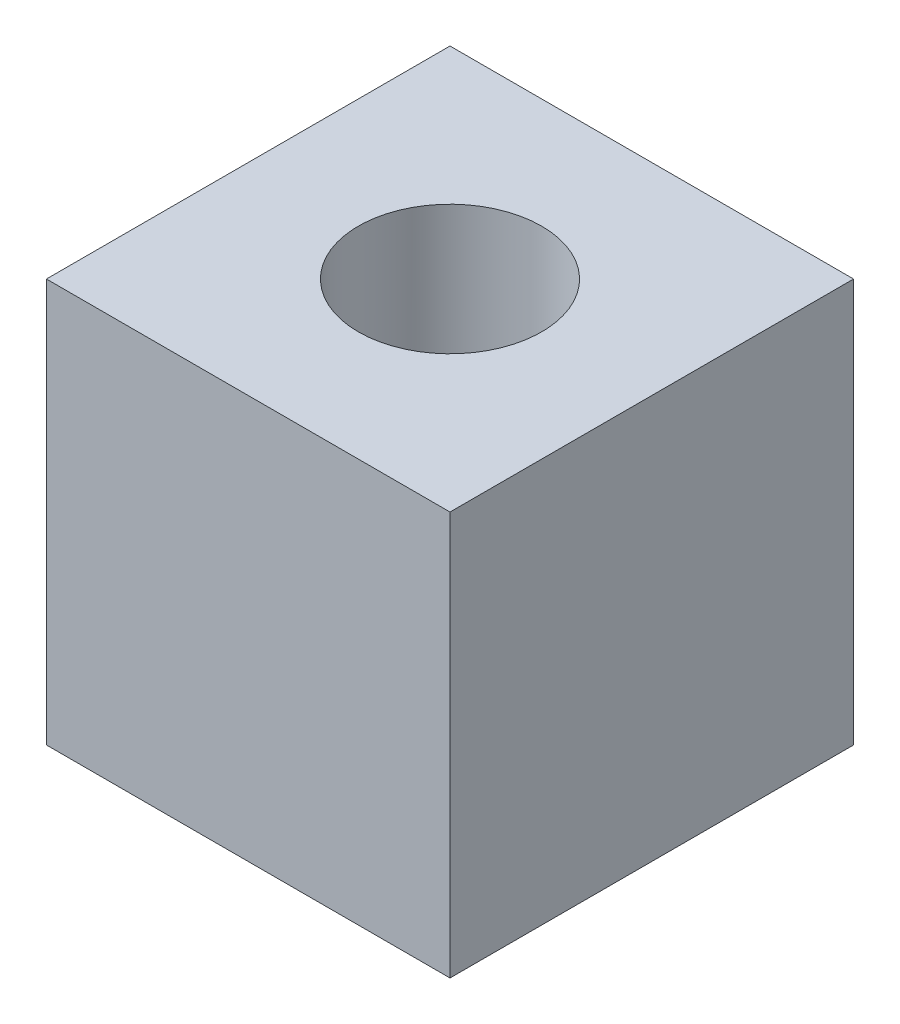
ISO-10303-21;
HEADER;
FILE_DESCRIPTION(('STEP AP214'),'2;1');
FILE_NAME('part.step','',(''),(''),'','','');
FILE_SCHEMA(('AUTOMOTIVE_DESIGN { 1 0 10303 214 1 1 1 1 }'));
ENDSEC;
DATA;
#1=APPLICATION_CONTEXT('core data for automotive mechanical design processes');
#2=APPLICATION_PROTOCOL_DEFINITION('international standard','automotive_design',2000,#1);
#3=PRODUCT_CONTEXT('',#1,'mechanical');
#4=PRODUCT('Part','Part','',(#3));
#5=PRODUCT_RELATED_PRODUCT_CATEGORY('part','',(#4));
#6=PRODUCT_DEFINITION_FORMATION('','',#4);
#7=PRODUCT_DEFINITION_CONTEXT('part definition',#1,'design');
#8=PRODUCT_DEFINITION('design','',#6,#7);
#9=PRODUCT_DEFINITION_SHAPE('','',#8);
#10=(LENGTH_UNIT() NAMED_UNIT(*) SI_UNIT(.MILLI.,.METRE.));
#11=(NAMED_UNIT(*) PLANE_ANGLE_UNIT() SI_UNIT($,.RADIAN.));
#12=(NAMED_UNIT(*) SI_UNIT($,.STERADIAN.) SOLID_ANGLE_UNIT());
#13=UNCERTAINTY_MEASURE_WITH_UNIT(LENGTH_MEASURE(1.E-05),#10,'distance_accuracy_value','');
#14=(GEOMETRIC_REPRESENTATION_CONTEXT(3) GLOBAL_UNCERTAINTY_ASSIGNED_CONTEXT((#13)) GLOBAL_UNIT_ASSIGNED_CONTEXT((#10,
#11,#12)) REPRESENTATION_CONTEXT('',''));
#15=CARTESIAN_POINT('',(0.,0.,0.));
#16=DIRECTION('',(0.,0.,1.));
#17=DIRECTION('',(1.,0.,0.));
#18=AXIS2_PLACEMENT_3D('',#15,#16,#17);
#19=CARTESIAN_POINT('',(0.,12.,0.));
#20=DIRECTION('',(0.,-1.,0.));
#21=DIRECTION('',(0.,0.,-1.));
#22=AXIS2_PLACEMENT_3D('',#19,#20,#21);
#23=CYLINDRICAL_SURFACE('',#22,2.725);
#24=CARTESIAN_POINT('',(0.,12.,0.));
#25=DIRECTION('',(0.,1.,0.));
#26=DIRECTION('',(0.,0.,1.));
#27=AXIS2_PLACEMENT_3D('',#24,#25,#26);
#28=CIRCLE('',#27,2.725);
#29=CARTESIAN_POINT('',(0.,12.,2.725));
#30=VERTEX_POINT('',#29);
#31=EDGE_CURVE('E103',#30,#30,#28,.T.);
#32=ORIENTED_EDGE('',*,*,#31,.T.);
#33=EDGE_LOOP('',(#32));
#34=FACE_BOUND('',#33,.T.);
#35=CARTESIAN_POINT('',(0.,4.,0.));
#36=DIRECTION('',(0.,-1.,0.));
#37=DIRECTION('',(0.,0.,-1.));
#38=AXIS2_PLACEMENT_3D('',#35,#36,#37);
#39=CIRCLE('',#38,2.725);
#40=CARTESIAN_POINT('',(0.,4.,-2.725));
#41=VERTEX_POINT('',#40);
#42=EDGE_CURVE('E120',#41,#41,#39,.F.);
#43=ORIENTED_EDGE('',*,*,#42,.F.);
#44=EDGE_LOOP('',(#43));
#45=FACE_BOUND('',#44,.T.);
#46=ADVANCED_FACE('F35',(#34,#45),#23,.F.);
#47=CARTESIAN_POINT('',(0.,12.,0.));
#48=DIRECTION('',(0.,-1.,0.));
#49=DIRECTION('',(0.,0.,-1.));
#50=AXIS2_PLACEMENT_3D('',#47,#48,#49);
#51=PLANE('',#50);
#52=DIRECTION('',(0.,0.,-1.));
#53=VECTOR('',#52,1.);
#54=CARTESIAN_POINT('',(6.,12.,6.));
#55=LINE('',#54,#53);
#56=CARTESIAN_POINT('',(6.,12.,6.));
#57=VERTEX_POINT('',#56);
#58=CARTESIAN_POINT('',(6.,12.,-6.));
#59=VERTEX_POINT('',#58);
#60=EDGE_CURVE('E88',#57,#59,#55,.T.);
#61=ORIENTED_EDGE('',*,*,#60,.T.);
#62=DIRECTION('',(-1.,0.,0.));
#63=VECTOR('',#62,1.);
#64=CARTESIAN_POINT('',(-6.,12.,-6.));
#65=LINE('',#64,#63);
#66=CARTESIAN_POINT('',(-6.,12.,-6.));
#67=VERTEX_POINT('',#66);
#68=EDGE_CURVE('E82',#59,#67,#65,.T.);
#69=ORIENTED_EDGE('',*,*,#68,.T.);
#70=DIRECTION('',(0.,0.,1.));
#71=VECTOR('',#70,1.);
#72=CARTESIAN_POINT('',(-6.,12.,6.));
#73=LINE('',#72,#71);
#74=CARTESIAN_POINT('',(-6.,12.,6.));
#75=VERTEX_POINT('',#74);
#76=EDGE_CURVE('E86',#67,#75,#73,.T.);
#77=ORIENTED_EDGE('',*,*,#76,.T.);
#78=DIRECTION('',(1.,0.,0.));
#79=VECTOR('',#78,1.);
#80=CARTESIAN_POINT('',(-6.,12.,6.));
#81=LINE('',#80,#79);
#82=EDGE_CURVE('E52',#75,#57,#81,.T.);
#83=ORIENTED_EDGE('',*,*,#82,.T.);
#84=EDGE_LOOP('',(#61,#69,#77,#83));
#85=FACE_BOUND('',#84,.T.);
#86=ORIENTED_EDGE('',*,*,#31,.F.);
#87=EDGE_LOOP('',(#86));
#88=FACE_BOUND('',#87,.T.);
#89=ADVANCED_FACE('F83',(#85,#88),#51,.F.);
#90=CARTESIAN_POINT('',(0.,0.,0.));
#91=DIRECTION('',(0.,-1.,0.));
#92=DIRECTION('',(0.,0.,-1.));
#93=AXIS2_PLACEMENT_3D('',#90,#91,#92);
#94=PLANE('',#93);
#95=DIRECTION('',(0.,0.,-1.));
#96=VECTOR('',#95,1.);
#97=CARTESIAN_POINT('',(6.,0.,6.));
#98=LINE('',#97,#96);
#99=CARTESIAN_POINT('',(6.,0.,6.));
#100=VERTEX_POINT('',#99);
#101=CARTESIAN_POINT('',(6.,0.,-6.));
#102=VERTEX_POINT('',#101);
#103=EDGE_CURVE('E100',#100,#102,#98,.T.);
#104=ORIENTED_EDGE('',*,*,#103,.F.);
#105=DIRECTION('',(1.,0.,0.));
#106=VECTOR('',#105,1.);
#107=CARTESIAN_POINT('',(-6.,0.,6.));
#108=LINE('',#107,#106);
#109=CARTESIAN_POINT('',(-6.,0.,6.));
#110=VERTEX_POINT('',#109);
#111=EDGE_CURVE('E75',#110,#100,#108,.T.);
#112=ORIENTED_EDGE('',*,*,#111,.F.);
#113=DIRECTION('',(0.,0.,1.));
#114=VECTOR('',#113,1.);
#115=CARTESIAN_POINT('',(-6.,0.,6.));
#116=LINE('',#115,#114);
#117=CARTESIAN_POINT('',(-6.,0.,-6.));
#118=VERTEX_POINT('',#117);
#119=EDGE_CURVE('E69',#118,#110,#116,.T.);
#120=ORIENTED_EDGE('',*,*,#119,.F.);
#121=DIRECTION('',(-1.,0.,0.));
#122=VECTOR('',#121,1.);
#123=CARTESIAN_POINT('',(-6.,0.,-6.));
#124=LINE('',#123,#122);
#125=EDGE_CURVE('E92',#102,#118,#124,.T.);
#126=ORIENTED_EDGE('',*,*,#125,.F.);
#127=EDGE_LOOP('',(#104,#112,#120,#126));
#128=FACE_BOUND('',#127,.T.);
#129=CARTESIAN_POINT('',(0.,0.,0.));
#130=DIRECTION('',(0.,-1.,0.));
#131=DIRECTION('',(0.,0.,-1.));
#132=AXIS2_PLACEMENT_3D('',#129,#130,#131);
#133=CIRCLE('',#132,2.25);
#134=CARTESIAN_POINT('',(0.,0.,-2.25));
#135=VERTEX_POINT('',#134);
#136=EDGE_CURVE('E121',#135,#135,#133,.T.);
#137=ORIENTED_EDGE('',*,*,#136,.F.);
#138=EDGE_LOOP('',(#137));
#139=FACE_BOUND('',#138,.T.);
#140=ADVANCED_FACE('F111',(#128,#139),#94,.T.);
#141=CARTESIAN_POINT('',(6.,12.,6.));
#142=DIRECTION('',(-1.,0.,0.));
#143=DIRECTION('',(0.,0.,1.));
#144=AXIS2_PLACEMENT_3D('',#141,#142,#143);
#145=PLANE('',#144);
#146=ORIENTED_EDGE('',*,*,#103,.T.);
#147=DIRECTION('',(0.,-1.,0.));
#148=VECTOR('',#147,1.);
#149=CARTESIAN_POINT('',(6.,12.,-6.));
#150=LINE('',#149,#148);
#151=EDGE_CURVE('E12',#59,#102,#150,.T.);
#152=ORIENTED_EDGE('',*,*,#151,.F.);
#153=ORIENTED_EDGE('',*,*,#60,.F.);
#154=DIRECTION('',(0.,-1.,0.));
#155=VECTOR('',#154,1.);
#156=CARTESIAN_POINT('',(6.,12.,6.));
#157=LINE('',#156,#155);
#158=EDGE_CURVE('E96',#57,#100,#157,.T.);
#159=ORIENTED_EDGE('',*,*,#158,.T.);
#160=EDGE_LOOP('',(#146,#152,#153,#159));
#161=FACE_BOUND('',#160,.T.);
#162=ADVANCED_FACE('F37',(#161),#145,.F.);
#163=CARTESIAN_POINT('',(-6.,12.,-6.));
#164=DIRECTION('',(0.,0.,1.));
#165=DIRECTION('',(1.,0.,0.));
#166=AXIS2_PLACEMENT_3D('',#163,#164,#165);
#167=PLANE('',#166);
#168=ORIENTED_EDGE('',*,*,#125,.T.);
#169=DIRECTION('',(0.,-1.,0.));
#170=VECTOR('',#169,1.);
#171=CARTESIAN_POINT('',(-6.,12.,-6.));
#172=LINE('',#171,#170);
#173=EDGE_CURVE('E44',#67,#118,#172,.T.);
#174=ORIENTED_EDGE('',*,*,#173,.F.);
#175=ORIENTED_EDGE('',*,*,#68,.F.);
#176=ORIENTED_EDGE('',*,*,#151,.T.);
#177=EDGE_LOOP('',(#168,#174,#175,#176));
#178=FACE_BOUND('',#177,.T.);
#179=ADVANCED_FACE('F91',(#178),#167,.F.);
#180=CARTESIAN_POINT('',(-6.,12.,6.));
#181=DIRECTION('',(1.,0.,0.));
#182=DIRECTION('',(0.,0.,-1.));
#183=AXIS2_PLACEMENT_3D('',#180,#181,#182);
#184=PLANE('',#183);
#185=ORIENTED_EDGE('',*,*,#119,.T.);
#186=DIRECTION('',(0.,-1.,0.));
#187=VECTOR('',#186,1.);
#188=CARTESIAN_POINT('',(-6.,12.,6.));
#189=LINE('',#188,#187);
#190=EDGE_CURVE('E93',#75,#110,#189,.T.);
#191=ORIENTED_EDGE('',*,*,#190,.F.);
#192=ORIENTED_EDGE('',*,*,#76,.F.);
#193=ORIENTED_EDGE('',*,*,#173,.T.);
#194=EDGE_LOOP('',(#185,#191,#192,#193));
#195=FACE_BOUND('',#194,.T.);
#196=ADVANCED_FACE('F94',(#195),#184,.F.);
#197=CARTESIAN_POINT('',(-6.,12.,6.));
#198=DIRECTION('',(0.,0.,-1.));
#199=DIRECTION('',(-1.,0.,0.));
#200=AXIS2_PLACEMENT_3D('',#197,#198,#199);
#201=PLANE('',#200);
#202=ORIENTED_EDGE('',*,*,#111,.T.);
#203=ORIENTED_EDGE('',*,*,#158,.F.);
#204=ORIENTED_EDGE('',*,*,#82,.F.);
#205=ORIENTED_EDGE('',*,*,#190,.T.);
#206=EDGE_LOOP('',(#202,#203,#204,#205));
#207=FACE_BOUND('',#206,.T.);
#208=ADVANCED_FACE('F108',(#207),#201,.F.);
#209=CARTESIAN_POINT('',(0.,19.7074639149334,0.));
#210=DIRECTION('',(0.,-1.,0.));
#211=DIRECTION('',(0.,0.,-1.));
#212=AXIS2_PLACEMENT_3D('',#209,#210,#211);
#213=CYLINDRICAL_SURFACE('',#212,2.25);
#214=CARTESIAN_POINT('',(0.,4.,0.));
#215=DIRECTION('',(0.,-1.,0.));
#216=DIRECTION('',(0.,0.,-1.));
#217=AXIS2_PLACEMENT_3D('',#214,#215,#216);
#218=CIRCLE('',#217,2.25);
#219=CARTESIAN_POINT('',(0.,4.,-2.25));
#220=VERTEX_POINT('',#219);
#221=EDGE_CURVE('E117',#220,#220,#218,.F.);
#222=ORIENTED_EDGE('',*,*,#221,.T.);
#223=EDGE_LOOP('',(#222));
#224=FACE_BOUND('',#223,.T.);
#225=ORIENTED_EDGE('',*,*,#136,.T.);
#226=EDGE_LOOP('',(#225));
#227=FACE_BOUND('',#226,.T.);
#228=ADVANCED_FACE('F138',(#224,#227),#213,.F.);
#229=CARTESIAN_POINT('',(0.,4.,0.));
#230=DIRECTION('',(0.,-1.,0.));
#231=DIRECTION('',(0.,0.,-1.));
#232=AXIS2_PLACEMENT_3D('',#229,#230,#231);
#233=PLANE('',#232);
#234=ORIENTED_EDGE('',*,*,#42,.T.);
#235=EDGE_LOOP('',(#234));
#236=FACE_BOUND('',#235,.T.);
#237=ORIENTED_EDGE('',*,*,#221,.F.);
#238=EDGE_LOOP('',(#237));
#239=FACE_BOUND('',#238,.T.);
#240=ADVANCED_FACE('F127',(#236,#239),#233,.F.);
#241=CLOSED_SHELL('',(#46,#89,#140,#162,#179,#196,#208,#228,#240));
#242=MANIFOLD_SOLID_BREP('B2',#241);
#243=ADVANCED_BREP_SHAPE_REPRESENTATION('',(#18,#242),#14);
#244=SHAPE_DEFINITION_REPRESENTATION(#9,#243);
ENDSEC;
END-ISO-10303-21;
